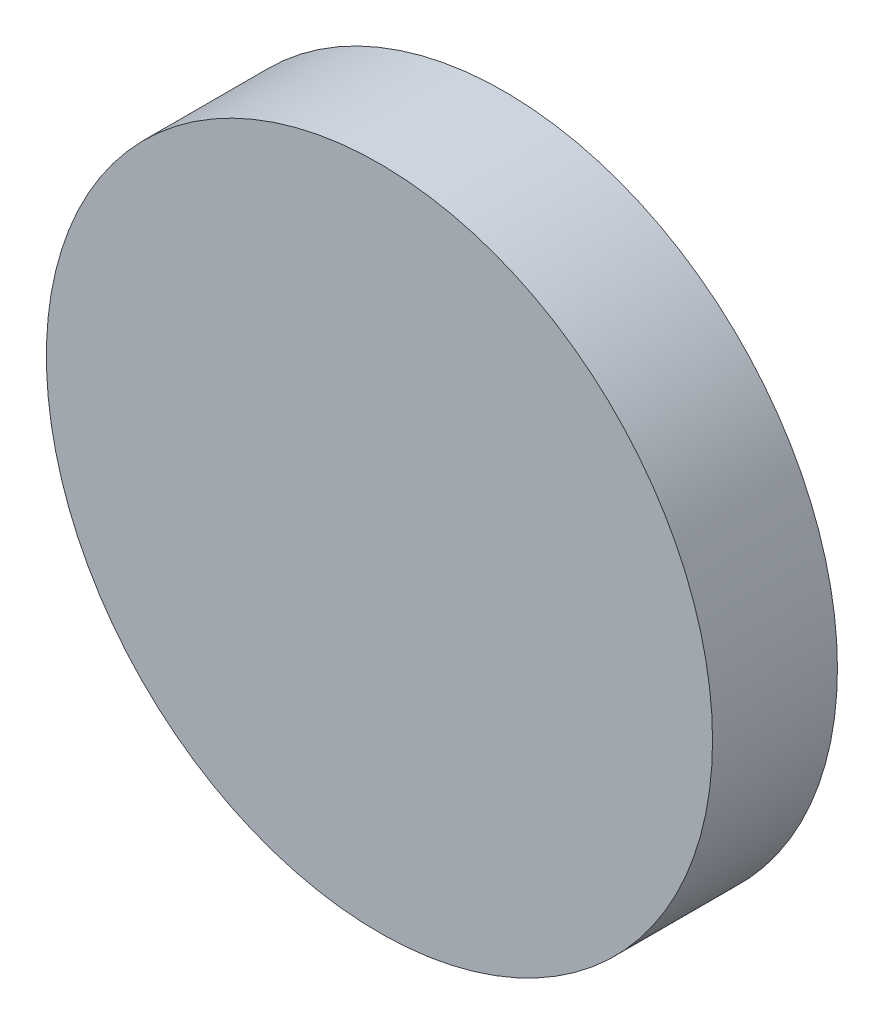
ISO-10303-21;
HEADER;
FILE_DESCRIPTION(('STEP AP214'),'2;1');
FILE_NAME('part.step','',(''),(''),'','','');
FILE_SCHEMA(('AUTOMOTIVE_DESIGN { 1 0 10303 214 1 1 1 1 }'));
ENDSEC;
DATA;
#1=APPLICATION_CONTEXT('core data for automotive mechanical design processes');
#2=APPLICATION_PROTOCOL_DEFINITION('international standard','automotive_design',2000,#1);
#3=PRODUCT_CONTEXT('',#1,'mechanical');
#4=PRODUCT('Part','Part','',(#3));
#5=PRODUCT_RELATED_PRODUCT_CATEGORY('part','',(#4));
#6=PRODUCT_DEFINITION_FORMATION('','',#4);
#7=PRODUCT_DEFINITION_CONTEXT('part definition',#1,'design');
#8=PRODUCT_DEFINITION('design','',#6,#7);
#9=PRODUCT_DEFINITION_SHAPE('','',#8);
#10=(LENGTH_UNIT() NAMED_UNIT(*) SI_UNIT(.MILLI.,.METRE.));
#11=(NAMED_UNIT(*) PLANE_ANGLE_UNIT() SI_UNIT($,.RADIAN.));
#12=(NAMED_UNIT(*) SI_UNIT($,.STERADIAN.) SOLID_ANGLE_UNIT());
#13=UNCERTAINTY_MEASURE_WITH_UNIT(LENGTH_MEASURE(1.E-05),#10,'distance_accuracy_value','');
#14=(GEOMETRIC_REPRESENTATION_CONTEXT(3) GLOBAL_UNCERTAINTY_ASSIGNED_CONTEXT((#13)) GLOBAL_UNIT_ASSIGNED_CONTEXT((#10,
#11,#12)) REPRESENTATION_CONTEXT('',''));
#15=CARTESIAN_POINT('',(0.,0.,0.));
#16=DIRECTION('',(0.,0.,1.));
#17=DIRECTION('',(1.,0.,0.));
#18=AXIS2_PLACEMENT_3D('',#15,#16,#17);
#19=CARTESIAN_POINT('',(0.,0.,3.));
#20=DIRECTION('',(0.,0.,-1.));
#21=DIRECTION('',(-1.,0.,0.));
#22=AXIS2_PLACEMENT_3D('',#19,#20,#21);
#23=CYLINDRICAL_SURFACE('',#22,8.);
#24=CARTESIAN_POINT('',(0.,0.,3.));
#25=DIRECTION('',(0.,0.,1.));
#26=DIRECTION('',(1.,0.,0.));
#27=AXIS2_PLACEMENT_3D('',#24,#25,#26);
#28=CIRCLE('',#27,8.);
#29=CARTESIAN_POINT('',(8.,0.,3.));
#30=VERTEX_POINT('',#29);
#31=EDGE_CURVE('E10',#30,#30,#28,.T.);
#32=ORIENTED_EDGE('',*,*,#31,.F.);
#33=EDGE_LOOP('',(#32));
#34=FACE_BOUND('',#33,.T.);
#35=CARTESIAN_POINT('',(0.,0.,0.));
#36=DIRECTION('',(0.,0.,1.));
#37=DIRECTION('',(1.,0.,0.));
#38=AXIS2_PLACEMENT_3D('',#35,#36,#37);
#39=CIRCLE('',#38,8.);
#40=CARTESIAN_POINT('',(8.,0.,0.));
#41=VERTEX_POINT('',#40);
#42=EDGE_CURVE('E32',#41,#41,#39,.T.);
#43=ORIENTED_EDGE('',*,*,#42,.T.);
#44=EDGE_LOOP('',(#43));
#45=FACE_BOUND('',#44,.T.);
#46=ADVANCED_FACE('F29',(#34,#45),#23,.T.);
#47=CARTESIAN_POINT('',(0.,0.,3.));
#48=DIRECTION('',(0.,0.,1.));
#49=DIRECTION('',(1.,0.,0.));
#50=AXIS2_PLACEMENT_3D('',#47,#48,#49);
#51=PLANE('',#50);
#52=ORIENTED_EDGE('',*,*,#31,.T.);
#53=EDGE_LOOP('',(#52));
#54=FACE_BOUND('',#53,.T.);
#55=ADVANCED_FACE('F44',(#54),#51,.T.);
#56=CARTESIAN_POINT('',(0.,0.,0.));
#57=DIRECTION('',(0.,0.,1.));
#58=DIRECTION('',(1.,0.,0.));
#59=AXIS2_PLACEMENT_3D('',#56,#57,#58);
#60=PLANE('',#59);
#61=ORIENTED_EDGE('',*,*,#42,.F.);
#62=EDGE_LOOP('',(#61));
#63=FACE_BOUND('',#62,.T.);
#64=ADVANCED_FACE('F42',(#63),#60,.F.);
#65=CLOSED_SHELL('',(#46,#55,#64));
#66=MANIFOLD_SOLID_BREP('B2',#65);
#67=ADVANCED_BREP_SHAPE_REPRESENTATION('',(#18,#66),#14);
#68=SHAPE_DEFINITION_REPRESENTATION(#9,#67);
ENDSEC;
END-ISO-10303-21;
